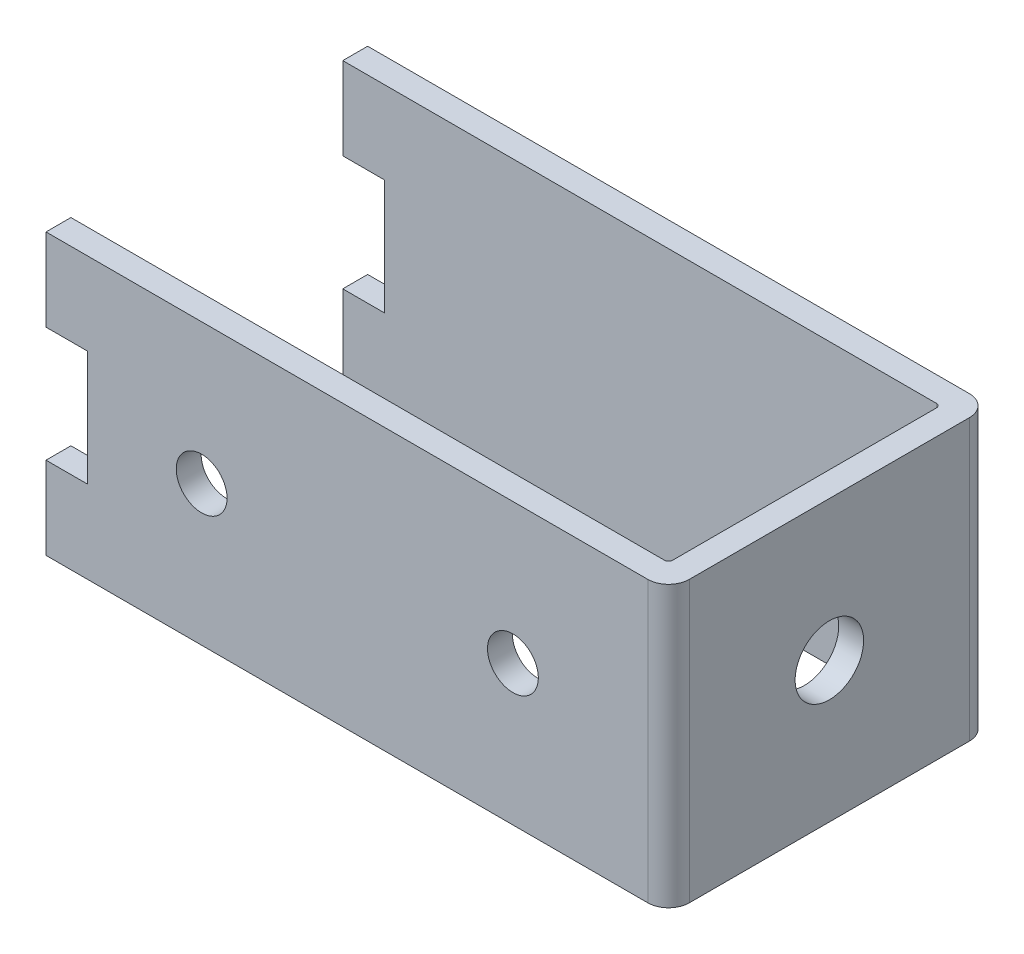
ISO-10303-21;
HEADER;
FILE_DESCRIPTION(('STEP AP214'),'2;1');
FILE_NAME('part.step','',(''),(''),'','','');
FILE_SCHEMA(('AUTOMOTIVE_DESIGN { 1 0 10303 214 1 1 1 1 }'));
ENDSEC;
DATA;
#1=APPLICATION_CONTEXT('core data for automotive mechanical design processes');
#2=APPLICATION_PROTOCOL_DEFINITION('international standard','automotive_design',2000,#1);
#3=PRODUCT_CONTEXT('',#1,'mechanical');
#4=PRODUCT('Part','Part','',(#3));
#5=PRODUCT_RELATED_PRODUCT_CATEGORY('part','',(#4));
#6=PRODUCT_DEFINITION_FORMATION('','',#4);
#7=PRODUCT_DEFINITION_CONTEXT('part definition',#1,'design');
#8=PRODUCT_DEFINITION('design','',#6,#7);
#9=PRODUCT_DEFINITION_SHAPE('','',#8);
#10=(LENGTH_UNIT() NAMED_UNIT(*) SI_UNIT(.MILLI.,.METRE.));
#11=(NAMED_UNIT(*) PLANE_ANGLE_UNIT() SI_UNIT($,.RADIAN.));
#12=(NAMED_UNIT(*) SI_UNIT($,.STERADIAN.) SOLID_ANGLE_UNIT());
#13=UNCERTAINTY_MEASURE_WITH_UNIT(LENGTH_MEASURE(1.E-05),#10,'distance_accuracy_value','');
#14=(GEOMETRIC_REPRESENTATION_CONTEXT(3) GLOBAL_UNCERTAINTY_ASSIGNED_CONTEXT((#13)) GLOBAL_UNIT_ASSIGNED_CONTEXT((#10,
#11,#12)) REPRESENTATION_CONTEXT('',''));
#15=CARTESIAN_POINT('',(0.,0.,0.));
#16=DIRECTION('',(0.,0.,1.));
#17=DIRECTION('',(1.,0.,0.));
#18=AXIS2_PLACEMENT_3D('',#15,#16,#17);
#19=CARTESIAN_POINT('',(-15.,6.75,-7.75));
#20=DIRECTION('',(1.,0.,0.));
#21=DIRECTION('',(0.,0.,-1.));
#22=AXIS2_PLACEMENT_3D('',#19,#20,#21);
#23=PLANE('',#22);
#24=DIRECTION('',(0.,-1.,0.));
#25=VECTOR('',#24,1.);
#26=CARTESIAN_POINT('',(-15.,6.75,-7.75));
#27=LINE('',#26,#25);
#28=CARTESIAN_POINT('',(-15.,6.75,-7.75));
#29=VERTEX_POINT('',#28);
#30=CARTESIAN_POINT('',(-15.,2.775,-7.75));
#31=VERTEX_POINT('',#30);
#32=EDGE_CURVE('E209',#29,#31,#27,.T.);
#33=ORIENTED_EDGE('',*,*,#32,.T.);
#34=DIRECTION('',(0.,0.,1.));
#35=VECTOR('',#34,1.);
#36=CARTESIAN_POINT('',(-15.,2.775,-7.75));
#37=LINE('',#36,#35);
#38=CARTESIAN_POINT('',(-15.,2.775,-6.55));
#39=VERTEX_POINT('',#38);
#40=EDGE_CURVE('E296',#31,#39,#37,.T.);
#41=ORIENTED_EDGE('',*,*,#40,.T.);
#42=DIRECTION('',(0.,1.,0.));
#43=VECTOR('',#42,1.);
#44=CARTESIAN_POINT('',(-15.,-6.75,-6.55));
#45=LINE('',#44,#43);
#46=CARTESIAN_POINT('',(-15.,6.75,-6.55));
#47=VERTEX_POINT('',#46);
#48=EDGE_CURVE('E346',#39,#47,#45,.T.);
#49=ORIENTED_EDGE('',*,*,#48,.T.);
#50=DIRECTION('',(0.,0.,1.));
#51=VECTOR('',#50,1.);
#52=CARTESIAN_POINT('',(-15.,6.75,-7.75));
#53=LINE('',#52,#51);
#54=EDGE_CURVE('E350',#29,#47,#53,.T.);
#55=ORIENTED_EDGE('',*,*,#54,.F.);
#56=EDGE_LOOP('',(#33,#41,#49,#55));
#57=FACE_BOUND('',#56,.T.);
#58=ADVANCED_FACE('F41',(#57),#23,.F.);
#59=DIRECTION('',(0.,1.,0.));
#60=VECTOR('',#59,1.);
#61=CARTESIAN_POINT('',(-15.,-6.75,6.55));
#62=LINE('',#61,#60);
#63=CARTESIAN_POINT('',(-15.,2.775,6.55));
#64=VERTEX_POINT('',#63);
#65=CARTESIAN_POINT('',(-15.,6.75,6.55));
#66=VERTEX_POINT('',#65);
#67=EDGE_CURVE('E341',#64,#66,#62,.T.);
#68=ORIENTED_EDGE('',*,*,#67,.F.);
#69=CARTESIAN_POINT('',(-15.,2.775,7.75));
#70=VERTEX_POINT('',#69);
#71=EDGE_CURVE('E292',#64,#70,#37,.T.);
#72=ORIENTED_EDGE('',*,*,#71,.T.);
#73=DIRECTION('',(0.,-1.,0.));
#74=VECTOR('',#73,1.);
#75=CARTESIAN_POINT('',(-15.,6.75,7.75));
#76=LINE('',#75,#74);
#77=CARTESIAN_POINT('',(-15.,6.75,7.75));
#78=VERTEX_POINT('',#77);
#79=EDGE_CURVE('E208',#78,#70,#76,.T.);
#80=ORIENTED_EDGE('',*,*,#79,.F.);
#81=EDGE_CURVE('E355',#66,#78,#53,.T.);
#82=ORIENTED_EDGE('',*,*,#81,.F.);
#83=EDGE_LOOP('',(#68,#72,#80,#82));
#84=FACE_BOUND('',#83,.T.);
#85=ADVANCED_FACE('F392',(#84),#23,.F.);
#86=CARTESIAN_POINT('',(-15.,-6.75,-6.55));
#87=VERTEX_POINT('',#86);
#88=CARTESIAN_POINT('',(-15.,-2.775,-6.55));
#89=VERTEX_POINT('',#88);
#90=EDGE_CURVE('E342',#87,#89,#45,.T.);
#91=ORIENTED_EDGE('',*,*,#90,.T.);
#92=DIRECTION('',(0.,0.,1.));
#93=VECTOR('',#92,1.);
#94=CARTESIAN_POINT('',(-15.,-2.775,-7.75));
#95=LINE('',#94,#93);
#96=CARTESIAN_POINT('',(-15.,-2.775,-7.75));
#97=VERTEX_POINT('',#96);
#98=EDGE_CURVE('E57',#97,#89,#95,.T.);
#99=ORIENTED_EDGE('',*,*,#98,.F.);
#100=CARTESIAN_POINT('',(-15.,-6.75,-7.75));
#101=VERTEX_POINT('',#100);
#102=EDGE_CURVE('E217',#97,#101,#27,.T.);
#103=ORIENTED_EDGE('',*,*,#102,.T.);
#104=DIRECTION('',(0.,0.,1.));
#105=VECTOR('',#104,1.);
#106=CARTESIAN_POINT('',(-15.,-6.75,-7.75));
#107=LINE('',#106,#105);
#108=EDGE_CURVE('E365',#101,#87,#107,.T.);
#109=ORIENTED_EDGE('',*,*,#108,.T.);
#110=EDGE_LOOP('',(#91,#99,#103,#109));
#111=FACE_BOUND('',#110,.T.);
#112=ADVANCED_FACE('F447',(#111),#23,.F.);
#113=CARTESIAN_POINT('',(-15.,-2.775,7.75));
#114=VERTEX_POINT('',#113);
#115=CARTESIAN_POINT('',(-15.,-6.75,7.75));
#116=VERTEX_POINT('',#115);
#117=EDGE_CURVE('E195',#114,#116,#76,.T.);
#118=ORIENTED_EDGE('',*,*,#117,.F.);
#119=CARTESIAN_POINT('',(-15.,-2.775,6.55));
#120=VERTEX_POINT('',#119);
#121=EDGE_CURVE('E177',#120,#114,#95,.T.);
#122=ORIENTED_EDGE('',*,*,#121,.F.);
#123=CARTESIAN_POINT('',(-15.,-6.75,6.55));
#124=VERTEX_POINT('',#123);
#125=EDGE_CURVE('E347',#124,#120,#62,.T.);
#126=ORIENTED_EDGE('',*,*,#125,.F.);
#127=EDGE_CURVE('E205',#124,#116,#107,.T.);
#128=ORIENTED_EDGE('',*,*,#127,.T.);
#129=EDGE_LOOP('',(#118,#122,#126,#128));
#130=FACE_BOUND('',#129,.T.);
#131=ADVANCED_FACE('F203',(#130),#23,.F.);
#132=CARTESIAN_POINT('',(-15.,6.75,7.75));
#133=DIRECTION('',(0.,0.,-1.));
#134=DIRECTION('',(-1.,0.,0.));
#135=AXIS2_PLACEMENT_3D('',#132,#133,#134);
#136=PLANE('',#135);
#137=CARTESIAN_POINT('',(7.50000000000001,0.,7.75));
#138=DIRECTION('',(0.,0.,1.));
#139=DIRECTION('',(1.,0.,0.));
#140=AXIS2_PLACEMENT_3D('',#137,#138,#139);
#141=CIRCLE('',#140,1.225);
#142=CARTESIAN_POINT('',(8.725,0.,7.75));
#143=VERTEX_POINT('',#142);
#144=EDGE_CURVE('E413',#143,#143,#141,.T.);
#145=ORIENTED_EDGE('',*,*,#144,.F.);
#146=EDGE_LOOP('',(#145));
#147=FACE_BOUND('',#146,.T.);
#148=CARTESIAN_POINT('',(-7.49999999999999,0.,7.75));
#149=DIRECTION('',(0.,0.,1.));
#150=DIRECTION('',(1.,0.,0.));
#151=AXIS2_PLACEMENT_3D('',#148,#149,#150);
#152=CIRCLE('',#151,1.225);
#153=CARTESIAN_POINT('',(-6.27499999999999,0.,7.75));
#154=VERTEX_POINT('',#153);
#155=EDGE_CURVE('E201',#154,#154,#152,.T.);
#156=ORIENTED_EDGE('',*,*,#155,.F.);
#157=EDGE_LOOP('',(#156));
#158=FACE_BOUND('',#157,.T.);
#159=ORIENTED_EDGE('',*,*,#79,.T.);
#160=DIRECTION('',(-1.,0.,0.));
#161=VECTOR('',#160,1.);
#162=CARTESIAN_POINT('',(-15.,2.775,7.75));
#163=LINE('',#162,#161);
#164=CARTESIAN_POINT('',(-13.,2.775,7.75));
#165=VERTEX_POINT('',#164);
#166=EDGE_CURVE('E409',#165,#70,#163,.T.);
#167=ORIENTED_EDGE('',*,*,#166,.F.);
#168=DIRECTION('',(0.,1.,0.));
#169=VECTOR('',#168,1.);
#170=CARTESIAN_POINT('',(-13.,2.775,7.75));
#171=LINE('',#170,#169);
#172=CARTESIAN_POINT('',(-13.,-2.775,7.75));
#173=VERTEX_POINT('',#172);
#174=EDGE_CURVE('E199',#173,#165,#171,.T.);
#175=ORIENTED_EDGE('',*,*,#174,.F.);
#176=DIRECTION('',(1.,0.,0.));
#177=VECTOR('',#176,1.);
#178=CARTESIAN_POINT('',(-15.,-2.775,7.75));
#179=LINE('',#178,#177);
#180=EDGE_CURVE('E180',#114,#173,#179,.T.);
#181=ORIENTED_EDGE('',*,*,#180,.F.);
#182=ORIENTED_EDGE('',*,*,#117,.T.);
#183=DIRECTION('',(1.,0.,0.));
#184=VECTOR('',#183,1.);
#185=CARTESIAN_POINT('',(-15.,-6.75,7.75));
#186=LINE('',#185,#184);
#187=CARTESIAN_POINT('',(14.,-6.75,7.75));
#188=VERTEX_POINT('',#187);
#189=EDGE_CURVE('E369',#116,#188,#186,.T.);
#190=ORIENTED_EDGE('',*,*,#189,.T.);
#191=DIRECTION('',(0.,-1.,0.));
#192=VECTOR('',#191,1.);
#193=CARTESIAN_POINT('',(14.,6.75,7.75));
#194=LINE('',#193,#192);
#195=CARTESIAN_POINT('',(14.,6.75,7.75));
#196=VERTEX_POINT('',#195);
#197=EDGE_CURVE('E233',#188,#196,#194,.F.);
#198=ORIENTED_EDGE('',*,*,#197,.T.);
#199=DIRECTION('',(1.,0.,0.));
#200=VECTOR('',#199,1.);
#201=CARTESIAN_POINT('',(-15.,6.75,7.75));
#202=LINE('',#201,#200);
#203=EDGE_CURVE('E354',#78,#196,#202,.T.);
#204=ORIENTED_EDGE('',*,*,#203,.F.);
#205=EDGE_LOOP('',(#159,#167,#175,#181,#182,#190,#198,#204));
#206=FACE_BOUND('',#205,.T.);
#207=ADVANCED_FACE('F193',(#147,#158,#206),#136,.F.);
#208=CARTESIAN_POINT('',(15.,6.75,-7.75));
#209=DIRECTION('',(-1.,0.,0.));
#210=DIRECTION('',(0.,0.,1.));
#211=AXIS2_PLACEMENT_3D('',#208,#209,#210);
#212=PLANE('',#211);
#213=CARTESIAN_POINT('',(15.,0.,0.));
#214=DIRECTION('',(1.,0.,0.));
#215=DIRECTION('',(0.,0.,-1.));
#216=AXIS2_PLACEMENT_3D('',#213,#214,#215);
#217=CIRCLE('',#216,1.65);
#218=CARTESIAN_POINT('',(15.,0.,-1.65));
#219=VERTEX_POINT('',#218);
#220=EDGE_CURVE('E311',#219,#219,#217,.T.);
#221=ORIENTED_EDGE('',*,*,#220,.F.);
#222=EDGE_LOOP('',(#221));
#223=FACE_BOUND('',#222,.T.);
#224=DIRECTION('',(0.,0.,-1.));
#225=VECTOR('',#224,1.);
#226=CARTESIAN_POINT('',(15.,6.75,-7.75));
#227=LINE('',#226,#225);
#228=CARTESIAN_POINT('',(15.,6.75,6.75));
#229=VERTEX_POINT('',#228);
#230=CARTESIAN_POINT('',(15.,6.75,-6.75));
#231=VERTEX_POINT('',#230);
#232=EDGE_CURVE('E359',#229,#231,#227,.T.);
#233=ORIENTED_EDGE('',*,*,#232,.F.);
#234=DIRECTION('',(0.,-1.,0.));
#235=VECTOR('',#234,1.);
#236=CARTESIAN_POINT('',(15.,6.75,6.75));
#237=LINE('',#236,#235);
#238=CARTESIAN_POINT('',(15.,-6.75,6.75));
#239=VERTEX_POINT('',#238);
#240=EDGE_CURVE('E223',#229,#239,#237,.T.);
#241=ORIENTED_EDGE('',*,*,#240,.T.);
#242=DIRECTION('',(0.,0.,-1.));
#243=VECTOR('',#242,1.);
#244=CARTESIAN_POINT('',(15.,-6.75,-7.75));
#245=LINE('',#244,#243);
#246=CARTESIAN_POINT('',(15.,-6.75,-6.75));
#247=VERTEX_POINT('',#246);
#248=EDGE_CURVE('E371',#239,#247,#245,.T.);
#249=ORIENTED_EDGE('',*,*,#248,.T.);
#250=DIRECTION('',(0.,-1.,0.));
#251=VECTOR('',#250,1.);
#252=CARTESIAN_POINT('',(15.,6.75,-6.75));
#253=LINE('',#252,#251);
#254=EDGE_CURVE('E214',#247,#231,#253,.F.);
#255=ORIENTED_EDGE('',*,*,#254,.T.);
#256=EDGE_LOOP('',(#233,#241,#249,#255));
#257=FACE_BOUND('',#256,.T.);
#258=ADVANCED_FACE('F471',(#223,#257),#212,.F.);
#259=CARTESIAN_POINT('',(-15.,6.75,-7.75));
#260=DIRECTION('',(0.,0.,1.));
#261=DIRECTION('',(1.,0.,0.));
#262=AXIS2_PLACEMENT_3D('',#259,#260,#261);
#263=PLANE('',#262);
#264=DIRECTION('',(0.,1.,0.));
#265=VECTOR('',#264,1.);
#266=CARTESIAN_POINT('',(-13.,2.775,-7.75));
#267=LINE('',#266,#265);
#268=CARTESIAN_POINT('',(-13.,-2.775,-7.75));
#269=VERTEX_POINT('',#268);
#270=CARTESIAN_POINT('',(-13.,2.775,-7.75));
#271=VERTEX_POINT('',#270);
#272=EDGE_CURVE('E434',#269,#271,#267,.T.);
#273=ORIENTED_EDGE('',*,*,#272,.T.);
#274=DIRECTION('',(-1.,0.,0.));
#275=VECTOR('',#274,1.);
#276=CARTESIAN_POINT('',(-15.,2.775,-7.75));
#277=LINE('',#276,#275);
#278=EDGE_CURVE('E189',#271,#31,#277,.T.);
#279=ORIENTED_EDGE('',*,*,#278,.T.);
#280=ORIENTED_EDGE('',*,*,#32,.F.);
#281=DIRECTION('',(-1.,0.,0.));
#282=VECTOR('',#281,1.);
#283=CARTESIAN_POINT('',(-15.,6.75,-7.75));
#284=LINE('',#283,#282);
#285=CARTESIAN_POINT('',(14.,6.75,-7.75));
#286=VERTEX_POINT('',#285);
#287=EDGE_CURVE('E362',#286,#29,#284,.T.);
#288=ORIENTED_EDGE('',*,*,#287,.F.);
#289=DIRECTION('',(0.,-1.,0.));
#290=VECTOR('',#289,1.);
#291=CARTESIAN_POINT('',(14.,6.75,-7.75));
#292=LINE('',#291,#290);
#293=CARTESIAN_POINT('',(14.,-6.75,-7.75));
#294=VERTEX_POINT('',#293);
#295=EDGE_CURVE('E242',#286,#294,#292,.T.);
#296=ORIENTED_EDGE('',*,*,#295,.T.);
#297=DIRECTION('',(-1.,0.,0.));
#298=VECTOR('',#297,1.);
#299=CARTESIAN_POINT('',(-15.,-6.75,-7.75));
#300=LINE('',#299,#298);
#301=EDGE_CURVE('E374',#294,#101,#300,.T.);
#302=ORIENTED_EDGE('',*,*,#301,.T.);
#303=ORIENTED_EDGE('',*,*,#102,.F.);
#304=DIRECTION('',(1.,0.,0.));
#305=VECTOR('',#304,1.);
#306=CARTESIAN_POINT('',(-15.,-2.775,-7.75));
#307=LINE('',#306,#305);
#308=EDGE_CURVE('E430',#97,#269,#307,.T.);
#309=ORIENTED_EDGE('',*,*,#308,.T.);
#310=EDGE_LOOP('',(#273,#279,#280,#288,#296,#302,#303,#309));
#311=FACE_BOUND('',#310,.T.);
#312=ADVANCED_FACE('F438',(#311),#263,.F.);
#313=CARTESIAN_POINT('',(0.,6.75,0.));
#314=DIRECTION('',(0.,1.,0.));
#315=DIRECTION('',(0.,0.,1.));
#316=AXIS2_PLACEMENT_3D('',#313,#314,#315);
#317=PLANE('',#316);
#318=ORIENTED_EDGE('',*,*,#203,.T.);
#319=CARTESIAN_POINT('',(14.,6.75,6.75));
#320=DIRECTION('',(0.,1.,0.));
#321=DIRECTION('',(0.,0.,1.));
#322=AXIS2_PLACEMENT_3D('',#319,#320,#321);
#323=CIRCLE('',#322,1.);
#324=EDGE_CURVE('E239',#196,#229,#323,.T.);
#325=ORIENTED_EDGE('',*,*,#324,.T.);
#326=ORIENTED_EDGE('',*,*,#232,.T.);
#327=CARTESIAN_POINT('',(14.,6.75,-6.75));
#328=DIRECTION('',(0.,1.,0.));
#329=DIRECTION('',(0.,0.,1.));
#330=AXIS2_PLACEMENT_3D('',#327,#328,#329);
#331=CIRCLE('',#330,1.);
#332=EDGE_CURVE('E236',#231,#286,#331,.T.);
#333=ORIENTED_EDGE('',*,*,#332,.T.);
#334=ORIENTED_EDGE('',*,*,#287,.T.);
#335=ORIENTED_EDGE('',*,*,#54,.T.);
#336=DIRECTION('',(-1.,0.,0.));
#337=VECTOR('',#336,1.);
#338=CARTESIAN_POINT('',(-15.,6.75,-6.55));
#339=LINE('',#338,#337);
#340=CARTESIAN_POINT('',(13.6,6.75,-6.55));
#341=VERTEX_POINT('',#340);
#342=EDGE_CURVE('E326',#341,#47,#339,.T.);
#343=ORIENTED_EDGE('',*,*,#342,.F.);
#344=CARTESIAN_POINT('',(13.6,6.75,-6.35));
#345=DIRECTION('',(0.,1.,0.));
#346=DIRECTION('',(0.,0.,1.));
#347=AXIS2_PLACEMENT_3D('',#344,#345,#346);
#348=CIRCLE('',#347,0.2);
#349=CARTESIAN_POINT('',(13.8,6.75,-6.35));
#350=VERTEX_POINT('',#349);
#351=EDGE_CURVE('E266',#341,#350,#348,.F.);
#352=ORIENTED_EDGE('',*,*,#351,.T.);
#353=DIRECTION('',(0.,0.,-1.));
#354=VECTOR('',#353,1.);
#355=CARTESIAN_POINT('',(13.8,6.75,6.54999999999999));
#356=LINE('',#355,#354);
#357=CARTESIAN_POINT('',(13.8,6.75,6.34999999999999));
#358=VERTEX_POINT('',#357);
#359=EDGE_CURVE('E322',#358,#350,#356,.T.);
#360=ORIENTED_EDGE('',*,*,#359,.F.);
#361=CARTESIAN_POINT('',(13.6,6.75,6.34999999999999));
#362=DIRECTION('',(0.,1.,0.));
#363=DIRECTION('',(0.,0.,1.));
#364=AXIS2_PLACEMENT_3D('',#361,#362,#363);
#365=CIRCLE('',#364,0.2);
#366=CARTESIAN_POINT('',(13.6,6.75,6.54999999999999));
#367=VERTEX_POINT('',#366);
#368=EDGE_CURVE('E260',#358,#367,#365,.F.);
#369=ORIENTED_EDGE('',*,*,#368,.T.);
#370=DIRECTION('',(1.,0.,0.));
#371=VECTOR('',#370,1.);
#372=CARTESIAN_POINT('',(-15.,6.75,6.55));
#373=LINE('',#372,#371);
#374=EDGE_CURVE('E319',#66,#367,#373,.T.);
#375=ORIENTED_EDGE('',*,*,#374,.F.);
#376=ORIENTED_EDGE('',*,*,#81,.T.);
#377=EDGE_LOOP('',(#318,#325,#326,#333,#334,#335,#343,#352,#360,#369,#375,#376));
#378=FACE_BOUND('',#377,.T.);
#379=ADVANCED_FACE('F386',(#378),#317,.T.);
#380=CARTESIAN_POINT('',(0.,-6.75,0.));
#381=DIRECTION('',(0.,1.,0.));
#382=DIRECTION('',(0.,0.,1.));
#383=AXIS2_PLACEMENT_3D('',#380,#381,#382);
#384=PLANE('',#383);
#385=ORIENTED_EDGE('',*,*,#248,.F.);
#386=CARTESIAN_POINT('',(14.,-6.75,6.75));
#387=DIRECTION('',(0.,1.,0.));
#388=DIRECTION('',(0.,0.,1.));
#389=AXIS2_PLACEMENT_3D('',#386,#387,#388);
#390=CIRCLE('',#389,1.);
#391=EDGE_CURVE('E230',#239,#188,#390,.F.);
#392=ORIENTED_EDGE('',*,*,#391,.T.);
#393=ORIENTED_EDGE('',*,*,#189,.F.);
#394=ORIENTED_EDGE('',*,*,#127,.F.);
#395=DIRECTION('',(1.,0.,0.));
#396=VECTOR('',#395,1.);
#397=CARTESIAN_POINT('',(-15.,-6.75,6.55));
#398=LINE('',#397,#396);
#399=CARTESIAN_POINT('',(13.6,-6.75,6.54999999999999));
#400=VERTEX_POINT('',#399);
#401=EDGE_CURVE('E330',#124,#400,#398,.T.);
#402=ORIENTED_EDGE('',*,*,#401,.T.);
#403=CARTESIAN_POINT('',(13.6,-6.75,6.34999999999999));
#404=DIRECTION('',(0.,1.,0.));
#405=DIRECTION('',(0.,0.,1.));
#406=AXIS2_PLACEMENT_3D('',#403,#404,#405);
#407=CIRCLE('',#406,0.2);
#408=CARTESIAN_POINT('',(13.8,-6.75,6.34999999999999));
#409=VERTEX_POINT('',#408);
#410=EDGE_CURVE('E263',#400,#409,#407,.T.);
#411=ORIENTED_EDGE('',*,*,#410,.T.);
#412=DIRECTION('',(0.,0.,-1.));
#413=VECTOR('',#412,1.);
#414=CARTESIAN_POINT('',(13.8,-6.75,6.54999999999999));
#415=LINE('',#414,#413);
#416=CARTESIAN_POINT('',(13.8,-6.75,-6.35));
#417=VERTEX_POINT('',#416);
#418=EDGE_CURVE('E334',#409,#417,#415,.T.);
#419=ORIENTED_EDGE('',*,*,#418,.T.);
#420=CARTESIAN_POINT('',(13.6,-6.75,-6.35));
#421=DIRECTION('',(0.,1.,0.));
#422=DIRECTION('',(0.,0.,1.));
#423=AXIS2_PLACEMENT_3D('',#420,#421,#422);
#424=CIRCLE('',#423,0.2);
#425=CARTESIAN_POINT('',(13.6,-6.75,-6.55));
#426=VERTEX_POINT('',#425);
#427=EDGE_CURVE('E269',#417,#426,#424,.T.);
#428=ORIENTED_EDGE('',*,*,#427,.T.);
#429=DIRECTION('',(-1.,0.,0.));
#430=VECTOR('',#429,1.);
#431=CARTESIAN_POINT('',(-15.,-6.75,-6.55));
#432=LINE('',#431,#430);
#433=EDGE_CURVE('E338',#426,#87,#432,.T.);
#434=ORIENTED_EDGE('',*,*,#433,.T.);
#435=ORIENTED_EDGE('',*,*,#108,.F.);
#436=ORIENTED_EDGE('',*,*,#301,.F.);
#437=CARTESIAN_POINT('',(14.,-6.75,-6.75));
#438=DIRECTION('',(0.,1.,0.));
#439=DIRECTION('',(0.,0.,1.));
#440=AXIS2_PLACEMENT_3D('',#437,#438,#439);
#441=CIRCLE('',#440,1.);
#442=EDGE_CURVE('E227',#294,#247,#441,.F.);
#443=ORIENTED_EDGE('',*,*,#442,.T.);
#444=EDGE_LOOP('',(#385,#392,#393,#394,#402,#411,#419,#428,#434,#435,#436,#443));
#445=FACE_BOUND('',#444,.T.);
#446=ADVANCED_FACE('F450',(#445),#384,.F.);
#447=CARTESIAN_POINT('',(-15.,-6.75,-6.55));
#448=DIRECTION('',(0.,0.,-1.));
#449=DIRECTION('',(-1.,0.,0.));
#450=AXIS2_PLACEMENT_3D('',#447,#448,#449);
#451=PLANE('',#450);
#452=ORIENTED_EDGE('',*,*,#48,.F.);
#453=DIRECTION('',(1.,0.,0.));
#454=VECTOR('',#453,1.);
#455=CARTESIAN_POINT('',(-15.,2.775,-6.55));
#456=LINE('',#455,#454);
#457=CARTESIAN_POINT('',(-13.,2.775,-6.55));
#458=VERTEX_POINT('',#457);
#459=EDGE_CURVE('E307',#39,#458,#456,.T.);
#460=ORIENTED_EDGE('',*,*,#459,.T.);
#461=DIRECTION('',(0.,-1.,0.));
#462=VECTOR('',#461,1.);
#463=CARTESIAN_POINT('',(-13.,-6.75,-6.55));
#464=LINE('',#463,#462);
#465=CARTESIAN_POINT('',(-13.,-2.775,-6.55));
#466=VERTEX_POINT('',#465);
#467=EDGE_CURVE('E303',#458,#466,#464,.T.);
#468=ORIENTED_EDGE('',*,*,#467,.T.);
#469=DIRECTION('',(-1.,0.,0.));
#470=VECTOR('',#469,1.);
#471=CARTESIAN_POINT('',(-15.,-2.775,-6.55));
#472=LINE('',#471,#470);
#473=EDGE_CURVE('E300',#466,#89,#472,.T.);
#474=ORIENTED_EDGE('',*,*,#473,.T.);
#475=ORIENTED_EDGE('',*,*,#90,.F.);
#476=ORIENTED_EDGE('',*,*,#433,.F.);
#477=DIRECTION('',(0.,1.,0.));
#478=VECTOR('',#477,1.);
#479=CARTESIAN_POINT('',(13.6,6.75,-6.55));
#480=LINE('',#479,#478);
#481=EDGE_CURVE('E256',#426,#341,#480,.T.);
#482=ORIENTED_EDGE('',*,*,#481,.T.);
#483=ORIENTED_EDGE('',*,*,#342,.T.);
#484=EDGE_LOOP('',(#452,#460,#468,#474,#475,#476,#482,#483));
#485=FACE_BOUND('',#484,.T.);
#486=ADVANCED_FACE('F405',(#485),#451,.F.);
#487=CARTESIAN_POINT('',(13.8,-6.75,6.54999999999999));
#488=DIRECTION('',(1.,0.,0.));
#489=DIRECTION('',(0.,0.,-1.));
#490=AXIS2_PLACEMENT_3D('',#487,#488,#489);
#491=PLANE('',#490);
#492=CARTESIAN_POINT('',(13.8,0.,0.));
#493=DIRECTION('',(1.,0.,0.));
#494=DIRECTION('',(0.,0.,-1.));
#495=AXIS2_PLACEMENT_3D('',#492,#493,#494);
#496=CIRCLE('',#495,1.65);
#497=CARTESIAN_POINT('',(13.8,0.,-1.65));
#498=VERTEX_POINT('',#497);
#499=EDGE_CURVE('E315',#498,#498,#496,.F.);
#500=ORIENTED_EDGE('',*,*,#499,.F.);
#501=EDGE_LOOP('',(#500));
#502=FACE_BOUND('',#501,.T.);
#503=ORIENTED_EDGE('',*,*,#418,.F.);
#504=DIRECTION('',(0.,1.,0.));
#505=VECTOR('',#504,1.);
#506=CARTESIAN_POINT('',(13.8,6.75,6.34999999999999));
#507=LINE('',#506,#505);
#508=EDGE_CURVE('E249',#409,#358,#507,.T.);
#509=ORIENTED_EDGE('',*,*,#508,.T.);
#510=ORIENTED_EDGE('',*,*,#359,.T.);
#511=DIRECTION('',(0.,1.,0.));
#512=VECTOR('',#511,1.);
#513=CARTESIAN_POINT('',(13.8,-6.75,-6.35));
#514=LINE('',#513,#512);
#515=EDGE_CURVE('E246',#350,#417,#514,.F.);
#516=ORIENTED_EDGE('',*,*,#515,.T.);
#517=EDGE_LOOP('',(#503,#509,#510,#516));
#518=FACE_BOUND('',#517,.T.);
#519=ADVANCED_FACE('F458',(#502,#518),#491,.F.);
#520=CARTESIAN_POINT('',(-15.,-6.75,6.55));
#521=DIRECTION('',(0.,0.,1.));
#522=DIRECTION('',(1.,0.,0.));
#523=AXIS2_PLACEMENT_3D('',#520,#521,#522);
#524=PLANE('',#523);
#525=CARTESIAN_POINT('',(7.50000000000001,0.,6.54999999999999));
#526=DIRECTION('',(0.,0.,1.));
#527=DIRECTION('',(1.,0.,0.));
#528=AXIS2_PLACEMENT_3D('',#525,#526,#527);
#529=CIRCLE('',#528,1.225);
#530=CARTESIAN_POINT('',(8.725,0.,6.54999999999999));
#531=VERTEX_POINT('',#530);
#532=EDGE_CURVE('E416',#531,#531,#529,.F.);
#533=ORIENTED_EDGE('',*,*,#532,.F.);
#534=EDGE_LOOP('',(#533));
#535=FACE_BOUND('',#534,.T.);
#536=CARTESIAN_POINT('',(-7.49999999999999,0.,6.55));
#537=DIRECTION('',(0.,0.,1.));
#538=DIRECTION('',(1.,0.,0.));
#539=AXIS2_PLACEMENT_3D('',#536,#537,#538);
#540=CIRCLE('',#539,1.225);
#541=CARTESIAN_POINT('',(-6.27499999999999,0.,6.55));
#542=VERTEX_POINT('',#541);
#543=EDGE_CURVE('E415',#542,#542,#540,.F.);
#544=ORIENTED_EDGE('',*,*,#543,.F.);
#545=EDGE_LOOP('',(#544));
#546=FACE_BOUND('',#545,.T.);
#547=DIRECTION('',(0.,1.,0.));
#548=VECTOR('',#547,1.);
#549=CARTESIAN_POINT('',(-13.,-6.75,6.55));
#550=LINE('',#549,#548);
#551=CARTESIAN_POINT('',(-13.,-2.775,6.55));
#552=VERTEX_POINT('',#551);
#553=CARTESIAN_POINT('',(-13.,2.775,6.55));
#554=VERTEX_POINT('',#553);
#555=EDGE_CURVE('E50',#552,#554,#550,.T.);
#556=ORIENTED_EDGE('',*,*,#555,.T.);
#557=DIRECTION('',(-1.,0.,0.));
#558=VECTOR('',#557,1.);
#559=CARTESIAN_POINT('',(-15.,2.775,6.55));
#560=LINE('',#559,#558);
#561=EDGE_CURVE('E11',#554,#64,#560,.T.);
#562=ORIENTED_EDGE('',*,*,#561,.T.);
#563=ORIENTED_EDGE('',*,*,#67,.T.);
#564=ORIENTED_EDGE('',*,*,#374,.T.);
#565=DIRECTION('',(0.,1.,0.));
#566=VECTOR('',#565,1.);
#567=CARTESIAN_POINT('',(13.6,-6.75,6.54999999999999));
#568=LINE('',#567,#566);
#569=EDGE_CURVE('E253',#367,#400,#568,.F.);
#570=ORIENTED_EDGE('',*,*,#569,.T.);
#571=ORIENTED_EDGE('',*,*,#401,.F.);
#572=ORIENTED_EDGE('',*,*,#125,.T.);
#573=DIRECTION('',(1.,0.,0.));
#574=VECTOR('',#573,1.);
#575=CARTESIAN_POINT('',(-15.,-2.775,6.55));
#576=LINE('',#575,#574);
#577=EDGE_CURVE('E183',#120,#552,#576,.T.);
#578=ORIENTED_EDGE('',*,*,#577,.T.);
#579=EDGE_LOOP('',(#556,#562,#563,#564,#570,#571,#572,#578));
#580=FACE_BOUND('',#579,.T.);
#581=ADVANCED_FACE('F277',(#535,#546,#580),#524,.F.);
#582=CARTESIAN_POINT('',(-15.001,0.,0.));
#583=DIRECTION('',(1.,0.,0.));
#584=DIRECTION('',(0.,0.,-1.));
#585=AXIS2_PLACEMENT_3D('',#582,#583,#584);
#586=CYLINDRICAL_SURFACE('',#585,1.65);
#587=ORIENTED_EDGE('',*,*,#220,.T.);
#588=EDGE_LOOP('',(#587));
#589=FACE_BOUND('',#588,.T.);
#590=ORIENTED_EDGE('',*,*,#499,.T.);
#591=EDGE_LOOP('',(#590));
#592=FACE_BOUND('',#591,.T.);
#593=ADVANCED_FACE('F482',(#589,#592),#586,.F.);
#594=CARTESIAN_POINT('',(14.,6.75,6.75));
#595=DIRECTION('',(0.,-1.,0.));
#596=DIRECTION('',(0.,0.,-1.));
#597=AXIS2_PLACEMENT_3D('',#594,#595,#596);
#598=CYLINDRICAL_SURFACE('',#597,1.);
#599=ORIENTED_EDGE('',*,*,#324,.F.);
#600=ORIENTED_EDGE('',*,*,#197,.F.);
#601=ORIENTED_EDGE('',*,*,#391,.F.);
#602=ORIENTED_EDGE('',*,*,#240,.F.);
#603=EDGE_LOOP('',(#599,#600,#601,#602));
#604=FACE_BOUND('',#603,.T.);
#605=ADVANCED_FACE('F466',(#604),#598,.T.);
#606=CARTESIAN_POINT('',(14.,6.75,-6.75));
#607=DIRECTION('',(0.,-1.,0.));
#608=DIRECTION('',(0.,0.,-1.));
#609=AXIS2_PLACEMENT_3D('',#606,#607,#608);
#610=CYLINDRICAL_SURFACE('',#609,1.);
#611=ORIENTED_EDGE('',*,*,#332,.F.);
#612=ORIENTED_EDGE('',*,*,#254,.F.);
#613=ORIENTED_EDGE('',*,*,#442,.F.);
#614=ORIENTED_EDGE('',*,*,#295,.F.);
#615=EDGE_LOOP('',(#611,#612,#613,#614));
#616=FACE_BOUND('',#615,.T.);
#617=ADVANCED_FACE('F474',(#616),#610,.T.);
#618=CARTESIAN_POINT('',(13.6,-6.75,6.34999999999999));
#619=DIRECTION('',(0.,-1.,0.));
#620=DIRECTION('',(0.,0.,-1.));
#621=AXIS2_PLACEMENT_3D('',#618,#619,#620);
#622=CYLINDRICAL_SURFACE('',#621,0.2);
#623=ORIENTED_EDGE('',*,*,#410,.F.);
#624=ORIENTED_EDGE('',*,*,#569,.F.);
#625=ORIENTED_EDGE('',*,*,#368,.F.);
#626=ORIENTED_EDGE('',*,*,#508,.F.);
#627=EDGE_LOOP('',(#623,#624,#625,#626));
#628=FACE_BOUND('',#627,.T.);
#629=ADVANCED_FACE('F462',(#628),#622,.F.);
#630=CARTESIAN_POINT('',(13.6,-6.75,-6.35));
#631=DIRECTION('',(0.,-1.,0.));
#632=DIRECTION('',(0.,0.,-1.));
#633=AXIS2_PLACEMENT_3D('',#630,#631,#632);
#634=CYLINDRICAL_SURFACE('',#633,0.2);
#635=ORIENTED_EDGE('',*,*,#427,.F.);
#636=ORIENTED_EDGE('',*,*,#515,.F.);
#637=ORIENTED_EDGE('',*,*,#351,.F.);
#638=ORIENTED_EDGE('',*,*,#481,.F.);
#639=EDGE_LOOP('',(#635,#636,#637,#638));
#640=FACE_BOUND('',#639,.T.);
#641=ADVANCED_FACE('F43',(#640),#634,.F.);
#642=CARTESIAN_POINT('',(-15.,-2.775,-7.75));
#643=DIRECTION('',(0.,-1.,0.));
#644=DIRECTION('',(0.,0.,-1.));
#645=AXIS2_PLACEMENT_3D('',#642,#643,#644);
#646=PLANE('',#645);
#647=ORIENTED_EDGE('',*,*,#121,.T.);
#648=ORIENTED_EDGE('',*,*,#180,.T.);
#649=DIRECTION('',(0.,0.,1.));
#650=VECTOR('',#649,1.);
#651=CARTESIAN_POINT('',(-13.,-2.775,-7.75));
#652=LINE('',#651,#650);
#653=EDGE_CURVE('E65',#552,#173,#652,.T.);
#654=ORIENTED_EDGE('',*,*,#653,.F.);
#655=ORIENTED_EDGE('',*,*,#577,.F.);
#656=EDGE_LOOP('',(#647,#648,#654,#655));
#657=FACE_BOUND('',#656,.T.);
#658=ADVANCED_FACE('F179',(#657),#646,.F.);
#659=CARTESIAN_POINT('',(-13.,2.775,-7.75));
#660=DIRECTION('',(1.,0.,0.));
#661=DIRECTION('',(0.,1.,0.));
#662=AXIS2_PLACEMENT_3D('',#659,#660,#661);
#663=PLANE('',#662);
#664=ORIENTED_EDGE('',*,*,#653,.T.);
#665=ORIENTED_EDGE('',*,*,#174,.T.);
#666=DIRECTION('',(0.,0.,1.));
#667=VECTOR('',#666,1.);
#668=CARTESIAN_POINT('',(-13.,2.775,-7.75));
#669=LINE('',#668,#667);
#670=EDGE_CURVE('E282',#554,#165,#669,.T.);
#671=ORIENTED_EDGE('',*,*,#670,.F.);
#672=ORIENTED_EDGE('',*,*,#555,.F.);
#673=EDGE_LOOP('',(#664,#665,#671,#672));
#674=FACE_BOUND('',#673,.T.);
#675=ADVANCED_FACE('F281',(#674),#663,.F.);
#676=CARTESIAN_POINT('',(-15.,2.775,-7.75));
#677=DIRECTION('',(0.,1.,0.));
#678=DIRECTION('',(-1.,0.,0.));
#679=AXIS2_PLACEMENT_3D('',#676,#677,#678);
#680=PLANE('',#679);
#681=ORIENTED_EDGE('',*,*,#670,.T.);
#682=ORIENTED_EDGE('',*,*,#166,.T.);
#683=ORIENTED_EDGE('',*,*,#71,.F.);
#684=ORIENTED_EDGE('',*,*,#561,.F.);
#685=EDGE_LOOP('',(#681,#682,#683,#684));
#686=FACE_BOUND('',#685,.T.);
#687=ADVANCED_FACE('F636',(#686),#680,.F.);
#688=ORIENTED_EDGE('',*,*,#40,.F.);
#689=ORIENTED_EDGE('',*,*,#278,.F.);
#690=EDGE_CURVE('E285',#271,#458,#669,.T.);
#691=ORIENTED_EDGE('',*,*,#690,.T.);
#692=ORIENTED_EDGE('',*,*,#459,.F.);
#693=EDGE_LOOP('',(#688,#689,#691,#692));
#694=FACE_BOUND('',#693,.T.);
#695=ADVANCED_FACE('F441',(#694),#680,.F.);
#696=ORIENTED_EDGE('',*,*,#690,.F.);
#697=ORIENTED_EDGE('',*,*,#272,.F.);
#698=EDGE_CURVE('E286',#269,#466,#652,.T.);
#699=ORIENTED_EDGE('',*,*,#698,.T.);
#700=ORIENTED_EDGE('',*,*,#467,.F.);
#701=EDGE_LOOP('',(#696,#697,#699,#700));
#702=FACE_BOUND('',#701,.T.);
#703=ADVANCED_FACE('F443',(#702),#663,.F.);
#704=ORIENTED_EDGE('',*,*,#698,.F.);
#705=ORIENTED_EDGE('',*,*,#308,.F.);
#706=ORIENTED_EDGE('',*,*,#98,.T.);
#707=ORIENTED_EDGE('',*,*,#473,.F.);
#708=EDGE_LOOP('',(#704,#705,#706,#707));
#709=FACE_BOUND('',#708,.T.);
#710=ADVANCED_FACE('F628',(#709),#646,.F.);
#711=CARTESIAN_POINT('',(-7.49999999999999,0.,-7.751));
#712=DIRECTION('',(0.,0.,1.));
#713=DIRECTION('',(1.,0.,0.));
#714=AXIS2_PLACEMENT_3D('',#711,#712,#713);
#715=CYLINDRICAL_SURFACE('',#714,1.225);
#716=ORIENTED_EDGE('',*,*,#155,.T.);
#717=EDGE_LOOP('',(#716));
#718=FACE_BOUND('',#717,.T.);
#719=ORIENTED_EDGE('',*,*,#543,.T.);
#720=EDGE_LOOP('',(#719));
#721=FACE_BOUND('',#720,.T.);
#722=ADVANCED_FACE('F665',(#718,#721),#715,.F.);
#723=CARTESIAN_POINT('',(7.50000000000001,0.,-7.751));
#724=DIRECTION('',(0.,0.,1.));
#725=DIRECTION('',(1.,0.,0.));
#726=AXIS2_PLACEMENT_3D('',#723,#724,#725);
#727=CYLINDRICAL_SURFACE('',#726,1.225);
#728=ORIENTED_EDGE('',*,*,#144,.T.);
#729=EDGE_LOOP('',(#728));
#730=FACE_BOUND('',#729,.T.);
#731=ORIENTED_EDGE('',*,*,#532,.T.);
#732=EDGE_LOOP('',(#731));
#733=FACE_BOUND('',#732,.T.);
#734=ADVANCED_FACE('F673',(#730,#733),#727,.F.);
#735=CLOSED_SHELL('',(#58,#85,#112,#131,#207,#258,#312,#379,#446,#486,#519,#581,#593,#605,#617,
#629,#641,#658,#675,#687,#695,#703,#710,#722,#734));
#736=MANIFOLD_SOLID_BREP('B2',#735);
#737=ADVANCED_BREP_SHAPE_REPRESENTATION('',(#18,#736),#14);
#738=SHAPE_DEFINITION_REPRESENTATION(#9,#737);
ENDSEC;
END-ISO-10303-21;
